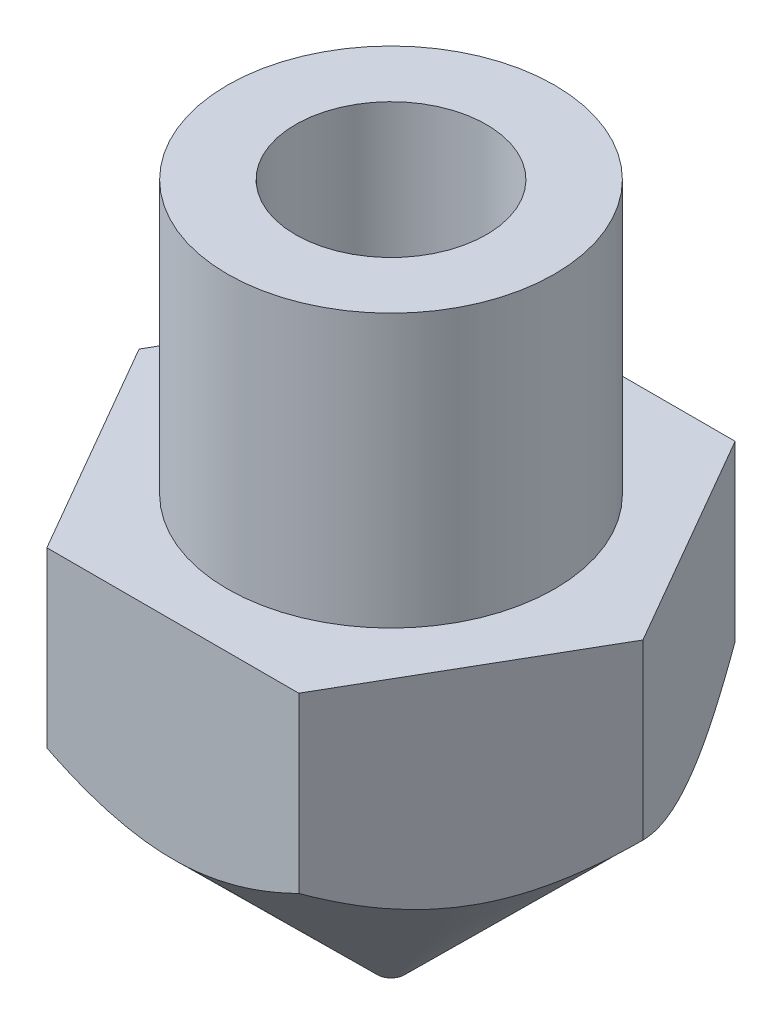
ISO-10303-21;
HEADER;
FILE_DESCRIPTION(('STEP AP214'),'2;1');
FILE_NAME('part.step','',(''),(''),'','','');
FILE_SCHEMA(('AUTOMOTIVE_DESIGN { 1 0 10303 214 1 1 1 1 }'));
ENDSEC;
DATA;
#1=APPLICATION_CONTEXT('core data for automotive mechanical design processes');
#2=APPLICATION_PROTOCOL_DEFINITION('international standard','automotive_design',2000,#1);
#3=PRODUCT_CONTEXT('',#1,'mechanical');
#4=PRODUCT('Part','Part','',(#3));
#5=PRODUCT_RELATED_PRODUCT_CATEGORY('part','',(#4));
#6=PRODUCT_DEFINITION_FORMATION('','',#4);
#7=PRODUCT_DEFINITION_CONTEXT('part definition',#1,'design');
#8=PRODUCT_DEFINITION('design','',#6,#7);
#9=PRODUCT_DEFINITION_SHAPE('','',#8);
#10=(LENGTH_UNIT() NAMED_UNIT(*) SI_UNIT(.MILLI.,.METRE.));
#11=(NAMED_UNIT(*) PLANE_ANGLE_UNIT() SI_UNIT($,.RADIAN.));
#12=(NAMED_UNIT(*) SI_UNIT($,.STERADIAN.) SOLID_ANGLE_UNIT());
#13=UNCERTAINTY_MEASURE_WITH_UNIT(LENGTH_MEASURE(1.E-05),#10,'distance_accuracy_value','');
#14=(GEOMETRIC_REPRESENTATION_CONTEXT(3) GLOBAL_UNCERTAINTY_ASSIGNED_CONTEXT((#13)) GLOBAL_UNIT_ASSIGNED_CONTEXT((#10,
#11,#12)) REPRESENTATION_CONTEXT('',''));
#15=CARTESIAN_POINT('',(0.,0.,0.));
#16=DIRECTION('',(0.,0.,1.));
#17=DIRECTION('',(1.,0.,0.));
#18=AXIS2_PLACEMENT_3D('',#15,#16,#17);
#19=CARTESIAN_POINT('',(0.,7.5,0.));
#20=DIRECTION('',(0.,1.,0.));
#21=DIRECTION('',(0.,0.,1.));
#22=AXIS2_PLACEMENT_3D('',#19,#20,#21);
#23=PLANE('',#22);
#24=DIRECTION('',(1.,0.,0.));
#25=VECTOR('',#24,1.);
#26=CARTESIAN_POINT('',(-2.3094010767585,7.5,4.));
#27=LINE('',#26,#25);
#28=CARTESIAN_POINT('',(-2.3094010767585,7.5,4.));
#29=VERTEX_POINT('',#28);
#30=CARTESIAN_POINT('',(2.3094010767585,7.5,4.));
#31=VERTEX_POINT('',#30);
#32=EDGE_CURVE('E145',#29,#31,#27,.T.);
#33=ORIENTED_EDGE('',*,*,#32,.T.);
#34=DIRECTION('',(0.5,0.,-0.866025403784439));
#35=VECTOR('',#34,1.);
#36=CARTESIAN_POINT('',(2.3094010767585,7.5,4.));
#37=LINE('',#36,#35);
#38=CARTESIAN_POINT('',(4.61880215351701,7.5,0.));
#39=VERTEX_POINT('',#38);
#40=EDGE_CURVE('E95',#31,#39,#37,.T.);
#41=ORIENTED_EDGE('',*,*,#40,.T.);
#42=DIRECTION('',(-0.5,0.,-0.866025403784438));
#43=VECTOR('',#42,1.);
#44=CARTESIAN_POINT('',(4.61880215351701,7.5,0.));
#45=LINE('',#44,#43);
#46=CARTESIAN_POINT('',(2.3094010767585,7.5,-4.));
#47=VERTEX_POINT('',#46);
#48=EDGE_CURVE('E153',#39,#47,#45,.T.);
#49=ORIENTED_EDGE('',*,*,#48,.T.);
#50=DIRECTION('',(-1.,0.,0.));
#51=VECTOR('',#50,1.);
#52=CARTESIAN_POINT('',(2.3094010767585,7.5,-4.));
#53=LINE('',#52,#51);
#54=CARTESIAN_POINT('',(-2.3094010767585,7.5,-4.));
#55=VERTEX_POINT('',#54);
#56=EDGE_CURVE('E155',#47,#55,#53,.T.);
#57=ORIENTED_EDGE('',*,*,#56,.T.);
#58=DIRECTION('',(-0.5,0.,0.866025403784439));
#59=VECTOR('',#58,1.);
#60=CARTESIAN_POINT('',(-2.3094010767585,7.5,-4.));
#61=LINE('',#60,#59);
#62=CARTESIAN_POINT('',(-4.61880215351701,7.5,0.));
#63=VERTEX_POINT('',#62);
#64=EDGE_CURVE('E157',#55,#63,#61,.T.);
#65=ORIENTED_EDGE('',*,*,#64,.T.);
#66=DIRECTION('',(0.5,0.,0.866025403784439));
#67=VECTOR('',#66,1.);
#68=CARTESIAN_POINT('',(-4.61880215351701,7.5,0.));
#69=LINE('',#68,#67);
#70=EDGE_CURVE('E57',#63,#29,#69,.T.);
#71=ORIENTED_EDGE('',*,*,#70,.T.);
#72=EDGE_LOOP('',(#33,#41,#49,#57,#65,#71));
#73=FACE_BOUND('',#72,.T.);
#74=CARTESIAN_POINT('',(0.,7.5,0.));
#75=DIRECTION('',(0.,1.,0.));
#76=DIRECTION('',(0.,0.,1.));
#77=AXIS2_PLACEMENT_3D('',#74,#75,#76);
#78=CIRCLE('',#77,3.);
#79=CARTESIAN_POINT('',(0.,7.5,3.));
#80=VERTEX_POINT('',#79);
#81=EDGE_CURVE('E185',#80,#80,#78,.T.);
#82=ORIENTED_EDGE('',*,*,#81,.F.);
#83=EDGE_LOOP('',(#82));
#84=FACE_BOUND('',#83,.T.);
#85=ADVANCED_FACE('F34',(#73,#84),#23,.T.);
#86=CARTESIAN_POINT('',(0.,4.5,0.));
#87=DIRECTION('',(0.,1.,0.));
#88=DIRECTION('',(0.,0.,1.));
#89=AXIS2_PLACEMENT_3D('',#86,#87,#88);
#90=CONICAL_SURFACE('',#89,4.8,0.790922969063121);
#91=CARTESIAN_POINT('',(0.,0.,0.));
#92=DIRECTION('',(0.,-1.,0.));
#93=DIRECTION('',(0.,0.,-1.));
#94=AXIS2_PLACEMENT_3D('',#91,#92,#93);
#95=CIRCLE('',#94,0.25);
#96=CARTESIAN_POINT('',(0.,0.,-0.25));
#97=VERTEX_POINT('',#96);
#98=EDGE_CURVE('E42',#97,#97,#95,.T.);
#99=ORIENTED_EDGE('',*,*,#98,.F.);
#100=EDGE_LOOP('',(#99));
#101=FACE_BOUND('',#100,.T.);
#102=CARTESIAN_POINT('',(-4.61891762357085,4.32090754407778,-0.000199999999998878));
#103=CARTESIAN_POINT('',(-4.57882495548949,4.28125961564317,0.0692425381279071));
#104=CARTESIAN_POINT('',(-4.53842796110676,4.24284516066987,0.139212184871867));
#105=CARTESIAN_POINT('',(-4.4569628253499,4.16885983041855,0.280313939048247));
#106=CARTESIAN_POINT('',(-4.41589432989499,4.13329051770299,0.351446659766554));
#107=CARTESIAN_POINT('',(-4.29121033757663,4.03111562789061,0.567405669352489));
#108=CARTESIAN_POINT('',(-4.20654503780905,3.96947665873758,0.714050270187991));
#109=CARTESIAN_POINT('',(-4.03589702788696,3.86422368139055,1.00962129358357));
#110=CARTESIAN_POINT('',(-3.94995729149691,3.82033617404732,1.1584732834002));
#111=CARTESIAN_POINT('',(-3.77623311133247,3.75315653543825,1.45937238994826));
#112=CARTESIAN_POINT('',(-3.68845382855752,3.7298130815824,1.61141056756643));
#113=CARTESIAN_POINT('',(-3.53675604717737,3.70940505433758,1.87415883231233));
#114=CARTESIAN_POINT('',(-3.47301486726647,3.70682488068493,1.98456179445239));
#115=CARTESIAN_POINT('',(-3.34566913691557,3.71372264549082,2.20513106954712));
#116=CARTESIAN_POINT('',(-3.28206464483688,3.72320498548024,2.31529728141703));
#117=CARTESIAN_POINT('',(-3.15549048959605,3.75367773030943,2.53453014921925));
#118=CARTESIAN_POINT('',(-3.09252161957529,3.77468104696966,2.6435954313904));
#119=CARTESIAN_POINT('',(-2.96768892179338,3.82704161264196,2.85981200639457));
#120=CARTESIAN_POINT('',(-2.905825003388,3.85839800819329,2.96696345622798));
#121=CARTESIAN_POINT('',(-2.79838956072751,3.92127040601549,3.1530471014496));
#122=CARTESIAN_POINT('',(-2.75253243548431,3.95087328101029,3.23247397225988));
#123=CARTESIAN_POINT('',(-2.66160326124224,4.01454526107256,3.38996792193743));
#124=CARTESIAN_POINT('',(-2.61653119364528,4.04861426017364,3.46803503301754));
#125=CARTESIAN_POINT('',(-2.52732037219057,4.12050605923579,3.62255270836204));
#126=CARTESIAN_POINT('',(-2.48317903489612,4.15831613605795,3.69900774727008));
#127=CARTESIAN_POINT('',(-2.3956675049615,4.23725128508008,3.85058216336492));
#128=CARTESIAN_POINT('',(-2.35229695170507,4.2783747544414,3.92570216515743));
#129=CARTESIAN_POINT('',(-2.30928560670467,4.32090754407778,4.0002));
#130=B_SPLINE_CURVE_WITH_KNOTS('',3,(#102,#103,#104,#105,#106,#107,#108,#109,#110,#111,#112,
#113,#114,#115,#116,#117,#118,#119,#120,#121,#122,#123,#124,#125,#126,#127,#128,#129),
.UNSPECIFIED.,.F.,.F.,(4,2,2,2,2,2,2,2,2,2,2,2,2,4),(0.,0.268335404709064,0.536817182543903,
1.07665606883723,1.60782795457851,2.13766908351982,2.51964973618756,2.90176981103991,
3.28431901412438,3.66683668946327,3.9558384161142,4.24483328694775,4.53287704734197,
4.82078229494866),.UNSPECIFIED.);
#131=CARTESIAN_POINT('',(-4.61880215351701,4.3207933386432,0.));
#132=VERTEX_POINT('',#131);
#133=CARTESIAN_POINT('',(-2.3094010767585,4.3207933386432,4.));
#134=VERTEX_POINT('',#133);
#135=EDGE_CURVE('E139',#132,#134,#130,.T.);
#136=ORIENTED_EDGE('',*,*,#135,.F.);
#137=CARTESIAN_POINT('',(-2.30928560670467,4.32090754407778,-4.0002));
#138=CARTESIAN_POINT('',(-2.34937827478602,4.28125961564317,-3.9307574618721));
#139=CARTESIAN_POINT('',(-2.38977526916875,4.24284516066987,-3.86078781512814));
#140=CARTESIAN_POINT('',(-2.47124040492561,4.16885983041855,-3.71968606095176));
#141=CARTESIAN_POINT('',(-2.51230890038052,4.13329051770299,-3.64855334023345));
#142=CARTESIAN_POINT('',(-2.63699289269888,4.03111562789061,-3.43259433064751));
#143=CARTESIAN_POINT('',(-2.72165819246647,3.96947665873758,-3.28594972981201));
#144=CARTESIAN_POINT('',(-2.89230620238856,3.86422368139055,-2.99037870641643));
#145=CARTESIAN_POINT('',(-2.9782459387786,3.82033617404732,-2.8415267165998));
#146=CARTESIAN_POINT('',(-3.15197011894304,3.75315653543825,-2.54062761005174));
#147=CARTESIAN_POINT('',(-3.23974940171799,3.7298130815824,-2.38858943243357));
#148=CARTESIAN_POINT('',(-3.39144718309814,3.70940505433758,-2.12584116768767));
#149=CARTESIAN_POINT('',(-3.45518836300904,3.70682488068493,-2.01543820554761));
#150=CARTESIAN_POINT('',(-3.58253409335994,3.71372264549082,-1.79486893045288));
#151=CARTESIAN_POINT('',(-3.64613858543864,3.72320498548024,-1.68470271858297));
#152=CARTESIAN_POINT('',(-3.77271274067946,3.75367773030943,-1.46546985078075));
#153=CARTESIAN_POINT('',(-3.83568161070022,3.77468104696966,-1.3564045686096));
#154=CARTESIAN_POINT('',(-3.96051430848213,3.82704161264196,-1.14018799360543));
#155=CARTESIAN_POINT('',(-4.02237822688751,3.85839800819329,-1.03303654377202));
#156=CARTESIAN_POINT('',(-4.129813669548,3.92127040601549,-0.846952898550396));
#157=CARTESIAN_POINT('',(-4.17567079479121,3.95087328101029,-0.767526027740119));
#158=CARTESIAN_POINT('',(-4.26659996903328,4.01454526107256,-0.610032078062571));
#159=CARTESIAN_POINT('',(-4.31167203663024,4.04861426017364,-0.531964966982455));
#160=CARTESIAN_POINT('',(-4.40088285808494,4.12050605923579,-0.377447291637957));
#161=CARTESIAN_POINT('',(-4.44502419537939,4.15831613605795,-0.300992252729924));
#162=CARTESIAN_POINT('',(-4.53253572531402,4.23725128508008,-0.149417836635076));
#163=CARTESIAN_POINT('',(-4.57590627857044,4.2783747544414,-0.0742978348425742));
#164=CARTESIAN_POINT('',(-4.61891762357085,4.32090754407778,0.000200000000001305));
#165=B_SPLINE_CURVE_WITH_KNOTS('',3,(#137,#138,#139,#140,#141,#142,#143,#144,#145,#146,#147,
#148,#149,#150,#151,#152,#153,#154,#155,#156,#157,#158,#159,#160,#161,#162,#163,#164),
.UNSPECIFIED.,.F.,.F.,(4,2,2,2,2,2,2,2,2,2,2,2,2,4),(0.,0.268335404709064,0.536817182543904,
1.07665606883723,1.60782795457851,2.13766908351982,2.51964973618756,2.90176981103992,
3.28431901412438,3.66683668946327,3.9558384161142,4.24483328694776,4.53287704734197,
4.82078229494866),.UNSPECIFIED.);
#166=CARTESIAN_POINT('',(-2.3094010767585,4.3207933386432,-4.));
#167=VERTEX_POINT('',#166);
#168=EDGE_CURVE('E146',#167,#132,#165,.T.);
#169=ORIENTED_EDGE('',*,*,#168,.F.);
#170=CARTESIAN_POINT('',(-4.77731163857638,5.91506405424429,-4.));
#171=CARTESIAN_POINT('',(-4.66126077615507,5.82708243242729,-4.));
#172=CARTESIAN_POINT('',(-4.54458595953393,5.73991073738884,-4.));
#173=CARTESIAN_POINT('',(-4.30973514801779,5.56755604823035,-4.));
#174=CARTESIAN_POINT('',(-4.19155880023948,5.48237353546564,-4.));
#175=CARTESIAN_POINT('',(-3.95259320215688,5.31376379565094,-4.));
#176=CARTESIAN_POINT('',(-3.83179085699568,5.23035506613229,-4.));
#177=CARTESIAN_POINT('',(-3.58818823690221,5.066517915432,-4.));
#178=CARTESIAN_POINT('',(-3.46538810041314,4.98608928899012,-4.));
#179=CARTESIAN_POINT('',(-3.20990578421158,4.82409833288653,-4.));
#180=CARTESIAN_POINT('',(-3.0770773635718,4.74276548234395,-4.));
#181=CARTESIAN_POINT('',(-2.80834425852088,4.5852657014932,-4.));
#182=CARTESIAN_POINT('',(-2.67243907554901,4.50909961651893,-4.));
#183=CARTESIAN_POINT('',(-2.3975330469381,4.36356734094716,-4.));
#184=CARTESIAN_POINT('',(-2.25854277846152,4.29418132754458,-4.));
#185=CARTESIAN_POINT('',(-1.9767234113964,4.16377376687841,-4.));
#186=CARTESIAN_POINT('',(-1.83389612106276,4.10274835947904,-4.));
#187=CARTESIAN_POINT('',(-1.55689665945426,3.99618374238921,-4.));
#188=CARTESIAN_POINT('',(-1.4230707936948,3.94975378193443,-4.));
#189=CARTESIAN_POINT('',(-1.15209990028743,3.86764138985129,-4.));
#190=CARTESIAN_POINT('',(-1.01495467741829,3.83195959202167,-4.));
#191=CARTESIAN_POINT('',(-0.740528034138379,3.77387377310477,-4.));
#192=CARTESIAN_POINT('',(-0.603297635734252,3.75123276625611,-4.));
#193=CARTESIAN_POINT('',(-0.327257805551723,3.719695915279,-4.));
#194=CARTESIAN_POINT('',(-0.18844868571891,3.71079740166846,-4.));
#195=CARTESIAN_POINT('',(0.0833156577788038,3.70746600345174,-4.));
#196=CARTESIAN_POINT('',(0.216263603134462,3.71242233216546,-4.));
#197=CARTESIAN_POINT('',(0.481050632819944,3.73515969728192,-4.));
#198=CARTESIAN_POINT('',(0.61288961086402,3.75294194909353,-4.));
#199=CARTESIAN_POINT('',(0.876775078791357,3.80064094216838,-4.));
#200=CARTESIAN_POINT('',(1.00878239537222,3.83077083014268,-4.));
#201=CARTESIAN_POINT('',(1.26990142237993,3.90151183394888,-4.));
#202=CARTESIAN_POINT('',(1.39901334083412,3.94212219414503,-4.));
#203=CARTESIAN_POINT('',(1.66582577894707,4.0362079876809,-4.));
#204=CARTESIAN_POINT('',(1.80322749879138,4.090521906478,-4.));
#205=CARTESIAN_POINT('',(2.07445199406885,4.20751937722464,-4.));
#206=CARTESIAN_POINT('',(2.2082730347371,4.2702069009376,-4.));
#207=CARTESIAN_POINT('',(2.4730058716959,4.40243105185092,-4.));
#208=CARTESIAN_POINT('',(2.60390674536753,4.47198936864017,-4.));
#209=CARTESIAN_POINT('',(2.86270843295825,4.61639805908972,-4.));
#210=CARTESIAN_POINT('',(2.99060973059525,4.69124757155634,-4.));
#211=CARTESIAN_POINT('',(3.23735926977747,4.84125627690671,-4.));
#212=CARTESIAN_POINT('',(3.35633636859995,4.9162046400833,-4.));
#213=CARTESIAN_POINT('',(3.59227321634881,5.06922174513348,-4.));
#214=CARTESIAN_POINT('',(3.70923281229704,5.14729072215322,-4.));
#215=CARTESIAN_POINT('',(3.94044605067062,5.30533524637891,-4.));
#216=CARTESIAN_POINT('',(4.05471401674976,5.38528991359446,-4.));
#217=CARTESIAN_POINT('',(4.28171556850662,5.54728644366551,-4.));
#218=CARTESIAN_POINT('',(4.39444956330772,5.62932773256148,-4.));
#219=CARTESIAN_POINT('',(4.50654316396615,5.71222016617809,-4.));
#220=B_SPLINE_CURVE_WITH_KNOTS('',3,(#170,#171,#172,#173,#174,#175,#176,#177,#178,#179,#180,
#181,#182,#183,#184,#185,#186,#187,#188,#189,#190,#191,#192,#193,#194,#195,#196,#197,#198,#199,
#200,#201,#202,#203,#204,#205,#206,#207,#208,#209,#210,#211,#212,#213,#214,#215,#216,#217,#218,
#219),.UNSPECIFIED.,.F.,.F.,(4,2,2,2,2,2,2,2,2,2,2,2,2,2,2,2,2,2,2,2,2,2,2,2,4),(0.,
0.436903027960649,0.873910707379933,1.31427355986555,1.75460602493115,2.22176628086166,
2.68900278539696,3.15482957774581,3.62044056533128,4.04502412567262,4.46963271800162,
4.88625956049741,5.30280546296068,5.70128120465317,6.09979471162629,6.50549835949394,
6.91117276454016,7.35406596369784,7.7971699866349,8.24172043657765,8.68619869745564,
9.10798885745471,9.52981086054628,9.9481743524885,10.3664239853633),.UNSPECIFIED.);
#221=CARTESIAN_POINT('',(2.3094010767585,4.3207933386432,-4.));
#222=VERTEX_POINT('',#221);
#223=EDGE_CURVE('E111',#222,#167,#220,.F.);
#224=ORIENTED_EDGE('',*,*,#223,.F.);
#225=CARTESIAN_POINT('',(4.61891762357084,4.32090754407778,0.000199999999999095));
#226=CARTESIAN_POINT('',(4.57882495548949,4.28125961564317,-0.0692425381279069));
#227=CARTESIAN_POINT('',(4.53842796110676,4.24284516066986,-0.139212184871867));
#228=CARTESIAN_POINT('',(4.4569628253499,4.16885983041854,-0.280313939048247));
#229=CARTESIAN_POINT('',(4.41589432989499,4.13329051770299,-0.351446659766554));
#230=CARTESIAN_POINT('',(4.29121033757663,4.03111562789061,-0.567405669352489));
#231=CARTESIAN_POINT('',(4.20654503780904,3.96947665873758,-0.714050270187991));
#232=CARTESIAN_POINT('',(4.03589702788696,3.86422368139055,-1.00962129358357));
#233=CARTESIAN_POINT('',(3.94995729149691,3.82033617404732,-1.1584732834002));
#234=CARTESIAN_POINT('',(3.77623311133247,3.75315653543825,-1.45937238994827));
#235=CARTESIAN_POINT('',(3.68845382855752,3.7298130815824,-1.61141056756643));
#236=CARTESIAN_POINT('',(3.53675604717737,3.70940505433758,-1.87415883231233));
#237=CARTESIAN_POINT('',(3.47301486726647,3.70682488068492,-1.98456179445239));
#238=CARTESIAN_POINT('',(3.34566913691557,3.71372264549082,-2.20513106954712));
#239=CARTESIAN_POINT('',(3.28206464483687,3.72320498548024,-2.31529728141703));
#240=CARTESIAN_POINT('',(3.15549048959605,3.75367773030943,-2.53453014921925));
#241=CARTESIAN_POINT('',(3.09252161957529,3.77468104696966,-2.6435954313904));
#242=CARTESIAN_POINT('',(2.96768892179338,3.82704161264196,-2.85981200639457));
#243=CARTESIAN_POINT('',(2.905825003388,3.85839800819329,-2.96696345622798));
#244=CARTESIAN_POINT('',(2.79838956072751,3.92127040601549,-3.1530471014496));
#245=CARTESIAN_POINT('',(2.7525324354843,3.95087328101029,-3.23247397225988));
#246=CARTESIAN_POINT('',(2.66160326124223,4.01454526107256,-3.38996792193743));
#247=CARTESIAN_POINT('',(2.61653119364527,4.04861426017364,-3.46803503301755));
#248=CARTESIAN_POINT('',(2.52732037219057,4.12050605923579,-3.62255270836204));
#249=CARTESIAN_POINT('',(2.48317903489611,4.15831613605795,-3.69900774727008));
#250=CARTESIAN_POINT('',(2.39566750496149,4.23725128508008,-3.85058216336493));
#251=CARTESIAN_POINT('',(2.35229695170507,4.2783747544414,-3.92570216515743));
#252=CARTESIAN_POINT('',(2.30928560670466,4.32090754407778,-4.0002));
#253=B_SPLINE_CURVE_WITH_KNOTS('',3,(#225,#226,#227,#228,#229,#230,#231,#232,#233,#234,#235,
#236,#237,#238,#239,#240,#241,#242,#243,#244,#245,#246,#247,#248,#249,#250,#251,#252),
.UNSPECIFIED.,.F.,.F.,(4,2,2,2,2,2,2,2,2,2,2,2,2,4),(0.,0.268335404709065,0.536817182543903,
1.07665606883723,1.60782795457851,2.13766908351982,2.51964973618756,2.90176981103992,
3.28431901412438,3.66683668946327,3.9558384161142,4.24483328694775,4.53287704734197,
4.82078229494866),.UNSPECIFIED.);
#254=CARTESIAN_POINT('',(4.61880215351701,4.32079333864319,0.));
#255=VERTEX_POINT('',#254);
#256=EDGE_CURVE('E109',#255,#222,#253,.T.);
#257=ORIENTED_EDGE('',*,*,#256,.F.);
#258=CARTESIAN_POINT('',(2.30928560670467,4.32090754407778,4.0002));
#259=CARTESIAN_POINT('',(2.34937827478602,4.28125961564317,3.9307574618721));
#260=CARTESIAN_POINT('',(2.38977526916875,4.24284516066986,3.86078781512813));
#261=CARTESIAN_POINT('',(2.47124040492561,4.16885983041855,3.71968606095175));
#262=CARTESIAN_POINT('',(2.51230890038052,4.13329051770299,3.64855334023345));
#263=CARTESIAN_POINT('',(2.63699289269888,4.03111562789061,3.43259433064751));
#264=CARTESIAN_POINT('',(2.72165819246647,3.96947665873758,3.28594972981201));
#265=CARTESIAN_POINT('',(2.89230620238855,3.86422368139055,2.99037870641643));
#266=CARTESIAN_POINT('',(2.9782459387786,3.82033617404732,2.8415267165998));
#267=CARTESIAN_POINT('',(3.15197011894304,3.75315653543825,2.54062761005174));
#268=CARTESIAN_POINT('',(3.23974940171799,3.7298130815824,2.38858943243357));
#269=CARTESIAN_POINT('',(3.39144718309814,3.70940505433758,2.12584116768768));
#270=CARTESIAN_POINT('',(3.45518836300904,3.70682488068493,2.01543820554761));
#271=CARTESIAN_POINT('',(3.58253409335994,3.71372264549082,1.79486893045288));
#272=CARTESIAN_POINT('',(3.64613858543863,3.72320498548024,1.68470271858297));
#273=CARTESIAN_POINT('',(3.77271274067946,3.75367773030943,1.46546985078075));
#274=CARTESIAN_POINT('',(3.83568161070022,3.77468104696966,1.3564045686096));
#275=CARTESIAN_POINT('',(3.96051430848213,3.82704161264196,1.14018799360543));
#276=CARTESIAN_POINT('',(4.02237822688751,3.85839800819329,1.03303654377202));
#277=CARTESIAN_POINT('',(4.129813669548,3.92127040601549,0.846952898550396));
#278=CARTESIAN_POINT('',(4.1756707947912,3.95087328101029,0.767526027740119));
#279=CARTESIAN_POINT('',(4.26659996903327,4.01454526107257,0.61003207806257));
#280=CARTESIAN_POINT('',(4.31167203663024,4.04861426017364,0.531964966982455));
#281=CARTESIAN_POINT('',(4.40088285808494,4.12050605923579,0.377447291637957));
#282=CARTESIAN_POINT('',(4.44502419537939,4.15831613605795,0.300992252729923));
#283=CARTESIAN_POINT('',(4.53253572531401,4.23725128508008,0.149417836635076));
#284=CARTESIAN_POINT('',(4.57590627857044,4.2783747544414,0.074297834842574));
#285=CARTESIAN_POINT('',(4.61891762357084,4.32090754407778,-0.000200000000001339));
#286=B_SPLINE_CURVE_WITH_KNOTS('',3,(#258,#259,#260,#261,#262,#263,#264,#265,#266,#267,#268,
#269,#270,#271,#272,#273,#274,#275,#276,#277,#278,#279,#280,#281,#282,#283,#284,#285),
.UNSPECIFIED.,.F.,.F.,(4,2,2,2,2,2,2,2,2,2,2,2,2,4),(0.,0.268335404709065,0.536817182543904,
1.07665606883723,1.60782795457851,2.13766908351982,2.51964973618756,2.90176981103992,
3.28431901412438,3.66683668946327,3.9558384161142,4.24483328694776,4.53287704734197,
4.82078229494866),.UNSPECIFIED.);
#287=CARTESIAN_POINT('',(2.3094010767585,4.3207933386432,4.));
#288=VERTEX_POINT('',#287);
#289=EDGE_CURVE('E93',#288,#255,#286,.T.);
#290=ORIENTED_EDGE('',*,*,#289,.F.);
#291=CARTESIAN_POINT('',(-4.77731163857638,5.91506405424429,4.));
#292=CARTESIAN_POINT('',(-4.66126077615507,5.82708243242729,4.));
#293=CARTESIAN_POINT('',(-4.54458595953393,5.73991073738884,4.));
#294=CARTESIAN_POINT('',(-4.30973514801779,5.56755604823035,4.));
#295=CARTESIAN_POINT('',(-4.19155880023948,5.48237353546564,4.));
#296=CARTESIAN_POINT('',(-3.95259320215687,5.31376379565093,4.));
#297=CARTESIAN_POINT('',(-3.83179085699568,5.23035506613229,4.));
#298=CARTESIAN_POINT('',(-3.58818823690221,5.066517915432,4.));
#299=CARTESIAN_POINT('',(-3.46538810041313,4.98608928899012,4.));
#300=CARTESIAN_POINT('',(-3.20990578421158,4.82409833288653,4.));
#301=CARTESIAN_POINT('',(-3.0770773635718,4.74276548234395,4.));
#302=CARTESIAN_POINT('',(-2.80834425852088,4.5852657014932,4.));
#303=CARTESIAN_POINT('',(-2.672439075549,4.50909961651893,4.));
#304=CARTESIAN_POINT('',(-2.3975330469381,4.36356734094716,4.));
#305=CARTESIAN_POINT('',(-2.25854277846152,4.29418132754458,4.));
#306=CARTESIAN_POINT('',(-1.9767234113964,4.16377376687841,4.));
#307=CARTESIAN_POINT('',(-1.83389612106276,4.10274835947904,4.));
#308=CARTESIAN_POINT('',(-1.55689665945426,3.99618374238921,4.));
#309=CARTESIAN_POINT('',(-1.4230707936948,3.94975378193443,4.));
#310=CARTESIAN_POINT('',(-1.15209990028743,3.86764138985129,4.));
#311=CARTESIAN_POINT('',(-1.01495467741829,3.83195959202167,4.));
#312=CARTESIAN_POINT('',(-0.740528034138379,3.77387377310477,4.));
#313=CARTESIAN_POINT('',(-0.60329763573425,3.75123276625611,4.));
#314=CARTESIAN_POINT('',(-0.327257805551722,3.719695915279,4.));
#315=CARTESIAN_POINT('',(-0.188448685718909,3.71079740166846,4.));
#316=CARTESIAN_POINT('',(0.0833156577788047,3.70746600345174,4.));
#317=CARTESIAN_POINT('',(0.216263603134463,3.71242233216546,4.));
#318=CARTESIAN_POINT('',(0.481050632819945,3.73515969728192,4.));
#319=CARTESIAN_POINT('',(0.612889610864021,3.75294194909353,4.));
#320=CARTESIAN_POINT('',(0.876775078791358,3.80064094216838,4.));
#321=CARTESIAN_POINT('',(1.00878239537222,3.83077083014268,4.));
#322=CARTESIAN_POINT('',(1.26990142237993,3.90151183394888,4.));
#323=CARTESIAN_POINT('',(1.39901334083412,3.94212219414502,4.));
#324=CARTESIAN_POINT('',(1.66582577894707,4.0362079876809,4.));
#325=CARTESIAN_POINT('',(1.80322749879138,4.090521906478,4.));
#326=CARTESIAN_POINT('',(2.07445199406885,4.20751937722464,4.));
#327=CARTESIAN_POINT('',(2.2082730347371,4.2702069009376,4.));
#328=CARTESIAN_POINT('',(2.4730058716959,4.40243105185092,4.));
#329=CARTESIAN_POINT('',(2.60390674536753,4.47198936864017,4.));
#330=CARTESIAN_POINT('',(2.86270843295825,4.61639805908972,4.));
#331=CARTESIAN_POINT('',(2.99060973059525,4.69124757155633,4.));
#332=CARTESIAN_POINT('',(3.23735926977747,4.84125627690671,4.));
#333=CARTESIAN_POINT('',(3.35633636859995,4.9162046400833,4.));
#334=CARTESIAN_POINT('',(3.59227321634881,5.06922174513348,4.));
#335=CARTESIAN_POINT('',(3.70923281229704,5.14729072215322,4.));
#336=CARTESIAN_POINT('',(3.94044605067062,5.30533524637891,4.));
#337=CARTESIAN_POINT('',(4.05471401674976,5.38528991359445,4.));
#338=CARTESIAN_POINT('',(4.28171556850662,5.54728644366551,4.));
#339=CARTESIAN_POINT('',(4.39444956330771,5.62932773256148,4.));
#340=CARTESIAN_POINT('',(4.50654316396614,5.71222016617809,4.));
#341=B_SPLINE_CURVE_WITH_KNOTS('',3,(#291,#292,#293,#294,#295,#296,#297,#298,#299,#300,#301,
#302,#303,#304,#305,#306,#307,#308,#309,#310,#311,#312,#313,#314,#315,#316,#317,#318,#319,#320,
#321,#322,#323,#324,#325,#326,#327,#328,#329,#330,#331,#332,#333,#334,#335,#336,#337,#338,#339,
#340),.UNSPECIFIED.,.F.,.F.,(4,2,2,2,2,2,2,2,2,2,2,2,2,2,2,2,2,2,2,2,2,2,2,2,4),(0.,
0.436903027960647,0.873910707379933,1.31427355986555,1.75460602493115,2.22176628086166,
2.68900278539696,3.15482957774581,3.62044056533128,4.04502412567262,4.46963271800162,
4.88625956049741,5.30280546296068,5.70128120465317,6.09979471162629,6.50549835949394,
6.91117276454016,7.35406596369784,7.7971699866349,8.24172043657765,8.68619869745563,
9.1079888574547,9.52981086054628,9.9481743524885,10.3664239853633),.UNSPECIFIED.);
#342=EDGE_CURVE('E100',#134,#288,#341,.T.);
#343=ORIENTED_EDGE('',*,*,#342,.F.);
#344=EDGE_LOOP('',(#136,#169,#224,#257,#290,#343));
#345=FACE_BOUND('',#344,.T.);
#346=ADVANCED_FACE('F106',(#101,#345),#90,.T.);
#347=CARTESIAN_POINT('',(0.,0.,0.));
#348=DIRECTION('',(0.,1.,0.));
#349=DIRECTION('',(0.,0.,1.));
#350=AXIS2_PLACEMENT_3D('',#347,#348,#349);
#351=CONICAL_SURFACE('',#350,0.2,0.523598775598293);
#352=CARTESIAN_POINT('',(0.,2.6846787517318,0.));
#353=DIRECTION('',(0.,-1.,0.));
#354=DIRECTION('',(0.,0.,-1.));
#355=AXIS2_PLACEMENT_3D('',#352,#353,#354);
#356=CIRCLE('',#355,1.75);
#357=CARTESIAN_POINT('',(0.,2.6846787517318,1.75));
#358=VERTEX_POINT('',#357);
#359=EDGE_CURVE('E96',#358,#358,#356,.T.);
#360=CARTESIAN_POINT('',(0.,0.,0.));
#361=DIRECTION('',(0.,-1.,0.));
#362=DIRECTION('',(0.,0.,-1.));
#363=AXIS2_PLACEMENT_3D('',#360,#361,#362);
#364=CIRCLE('',#363,0.2);
#365=CARTESIAN_POINT('',(0.,0.,0.2));
#366=VERTEX_POINT('',#365);
#367=EDGE_CURVE('E11',#366,#366,#364,.T.);
#368=CARTESIAN_POINT('',(0.,2.6846787517318,1.75));
#369=CARTESIAN_POINT('',(0.,2.65671334806792,1.73385416666667));
#370=CARTESIAN_POINT('',(0.,2.62874794440405,1.71770833333333));
#371=CARTESIAN_POINT('',(0.,2.57281713707631,1.68541666666667));
#372=CARTESIAN_POINT('',(0.,2.54485173341243,1.66927083333333));
#373=CARTESIAN_POINT('',(0.,2.48892092608469,1.63697916666667));
#374=CARTESIAN_POINT('',(0.,2.46095552242081,1.62083333333333));
#375=CARTESIAN_POINT('',(0.,2.40502471509307,1.58854166666667));
#376=CARTESIAN_POINT('',(0.,2.37705931142919,1.57239583333333));
#377=CARTESIAN_POINT('',(0.,2.32112850410145,1.54010416666667));
#378=CARTESIAN_POINT('',(0.,2.29316310043758,1.52395833333333));
#379=CARTESIAN_POINT('',(0.,2.23723229310983,1.49166666666667));
#380=CARTESIAN_POINT('',(0.,2.20926688944596,1.47552083333333));
#381=CARTESIAN_POINT('',(0.,2.15333608211821,1.44322916666667));
#382=CARTESIAN_POINT('',(0.,2.12537067845434,1.42708333333333));
#383=CARTESIAN_POINT('',(0.,2.06943987112659,1.39479166666667));
#384=CARTESIAN_POINT('',(0.,2.04147446746272,1.37864583333333));
#385=CARTESIAN_POINT('',(0.,1.98554366013497,1.34635416666667));
#386=CARTESIAN_POINT('',(0.,1.9575782564711,1.33020833333333));
#387=CARTESIAN_POINT('',(0.,1.90164744914336,1.29791666666667));
#388=CARTESIAN_POINT('',(0.,1.87368204547948,1.28177083333333));
#389=CARTESIAN_POINT('',(0.,1.81775123815174,1.24947916666667));
#390=CARTESIAN_POINT('',(0.,1.78978583448786,1.23333333333333));
#391=CARTESIAN_POINT('',(0.,1.73385502716012,1.20104166666667));
#392=CARTESIAN_POINT('',(0.,1.70588962349625,1.18489583333333));
#393=CARTESIAN_POINT('',(0.,1.6499588161685,1.15260416666667));
#394=CARTESIAN_POINT('',(0.,1.62199341250463,1.13645833333333));
#395=CARTESIAN_POINT('',(0.,1.56606260517688,1.10416666666667));
#396=CARTESIAN_POINT('',(0.,1.53809720151301,1.08802083333333));
#397=CARTESIAN_POINT('',(0.,1.48216639418526,1.05572916666667));
#398=CARTESIAN_POINT('',(0.,1.45420099052139,1.03958333333333));
#399=CARTESIAN_POINT('',(0.,1.39827018319364,1.00729166666667));
#400=CARTESIAN_POINT('',(0.,1.37030477952977,0.991145833333334));
#401=CARTESIAN_POINT('',(0.,1.31437397220203,0.958854166666667));
#402=CARTESIAN_POINT('',(0.,1.28640856853815,0.942708333333333));
#403=CARTESIAN_POINT('',(0.,1.23047776121041,0.910416666666667));
#404=CARTESIAN_POINT('',(0.,1.20251235754653,0.894270833333333));
#405=CARTESIAN_POINT('',(0.,1.14658155021879,0.861979166666667));
#406=CARTESIAN_POINT('',(0.,1.11861614655492,0.845833333333333));
#407=CARTESIAN_POINT('',(0.,1.06268533922717,0.813541666666667));
#408=CARTESIAN_POINT('',(0.,1.0347199355633,0.797395833333333));
#409=CARTESIAN_POINT('',(0.,0.978789128235551,0.765104166666667));
#410=CARTESIAN_POINT('',(0.,0.950823724571678,0.748958333333333));
#411=CARTESIAN_POINT('',(0.,0.894892917243932,0.716666666666667));
#412=CARTESIAN_POINT('',(0.,0.866927513580059,0.700520833333333));
#413=CARTESIAN_POINT('',(0.,0.810996706252314,0.668229166666667));
#414=CARTESIAN_POINT('',(0.,0.783031302588441,0.652083333333333));
#415=CARTESIAN_POINT('',(0.,0.727100495260695,0.619791666666667));
#416=CARTESIAN_POINT('',(0.,0.699135091596822,0.603645833333333));
#417=CARTESIAN_POINT('',(0.,0.643204284269077,0.571354166666667));
#418=CARTESIAN_POINT('',(0.,0.615238880605204,0.555208333333333));
#419=CARTESIAN_POINT('',(0.,0.559308073277458,0.522916666666667));
#420=CARTESIAN_POINT('',(0.,0.531342669613585,0.506770833333334));
#421=CARTESIAN_POINT('',(0.,0.475411862285839,0.474479166666667));
#422=CARTESIAN_POINT('',(0.,0.447446458621966,0.458333333333333));
#423=CARTESIAN_POINT('',(0.,0.391515651294221,0.426041666666667));
#424=CARTESIAN_POINT('',(0.,0.363550247630348,0.409895833333333));
#425=CARTESIAN_POINT('',(0.,0.307619440302602,0.377604166666667));
#426=CARTESIAN_POINT('',(0.,0.279654036638729,0.361458333333333));
#427=CARTESIAN_POINT('',(0.,0.223723229310983,0.329166666666667));
#428=CARTESIAN_POINT('',(0.,0.19575782564711,0.313020833333333));
#429=CARTESIAN_POINT('',(0.,0.139827018319364,0.280729166666667));
#430=CARTESIAN_POINT('',(0.,0.111861614655492,0.264583333333333));
#431=CARTESIAN_POINT('',(0.,0.0559308073277458,0.232291666666667));
#432=CARTESIAN_POINT('',(0.,0.0279654036638729,0.216145833333333));
#433=CARTESIAN_POINT('',(0.,0.,0.2));
#434=B_SPLINE_CURVE_WITH_KNOTS('',3,(#368,#369,#370,#371,#372,#373,#374,#375,#376,#377,#378,
#379,#380,#381,#382,#383,#384,#385,#386,#387,#388,#389,#390,#391,#392,#393,#394,#395,#396,#397,
#398,#399,#400,#401,#402,#403,#404,#405,#406,#407,#408,#409,#410,#411,#412,#413,#414,#415,#416,
#417,#418,#419,#420,#421,#422,#423,#424,#425,#426,#427,#428,#429,#430,#431,#432,#433),
.UNSPECIFIED.,.F.,.F.,(4,2,2,2,2,2,2,2,2,2,2,2,2,2,2,2,2,2,2,2,2,2,2,2,2,2,2,2,2,2,2,2,4),(0.,
0.0968750000000011,0.193750000000002,0.290625000000003,0.387500000000004,0.484375000000005,
0.581250000000006,0.678125000000007,0.775000000000008,0.871875000000009,0.96875000000001,
1.06562500000001,1.16250000000001,1.25937500000001,1.35625000000001,1.45312500000002,
1.55000000000002,1.64687500000002,1.74375000000002,1.84062500000002,1.93750000000002,
2.03437500000002,2.13125000000002,2.22812500000002,2.32500000000002,2.42187500000003,
2.51875000000003,2.61562500000003,2.71250000000003,2.80937500000003,2.90625000000003,
3.00312500000003,3.10000000000003),.UNSPECIFIED.);
#435=EDGE_CURVE('BSEAM36',#358,#366,#434,.T.);
#436=ORIENTED_EDGE('',*,*,#359,.F.);
#437=ORIENTED_EDGE('',*,*,#367,.T.);
#438=ORIENTED_EDGE('',*,*,#435,.T.);
#439=ORIENTED_EDGE('',*,*,#435,.F.);
#440=EDGE_LOOP('',(#436,#438,#437,#439));
#441=FACE_BOUND('',#440,.T.);
#442=ADVANCED_FACE('F36',(#441),#351,.F.);
#443=CARTESIAN_POINT('',(-0.2,0.,0.));
#444=DIRECTION('',(0.,1.,0.));
#445=DIRECTION('',(0.,0.,1.));
#446=AXIS2_PLACEMENT_3D('',#443,#444,#445);
#447=PLANE('',#446);
#448=ORIENTED_EDGE('',*,*,#367,.F.);
#449=EDGE_LOOP('',(#448));
#450=FACE_BOUND('',#449,.T.);
#451=ORIENTED_EDGE('',*,*,#98,.T.);
#452=EDGE_LOOP('',(#451));
#453=FACE_BOUND('',#452,.T.);
#454=ADVANCED_FACE('F172',(#450,#453),#447,.F.);
#455=CARTESIAN_POINT('',(0.,0.,0.));
#456=DIRECTION('',(0.,-1.,0.));
#457=DIRECTION('',(0.,0.,-1.));
#458=AXIS2_PLACEMENT_3D('',#455,#456,#457);
#459=CYLINDRICAL_SURFACE('',#458,1.75);
#460=ORIENTED_EDGE('',*,*,#359,.T.);
#461=EDGE_LOOP('',(#460));
#462=FACE_BOUND('',#461,.T.);
#463=CARTESIAN_POINT('',(0.,12.5,0.));
#464=DIRECTION('',(0.,1.,0.));
#465=DIRECTION('',(0.,0.,1.));
#466=AXIS2_PLACEMENT_3D('',#463,#464,#465);
#467=CIRCLE('',#466,1.75);
#468=CARTESIAN_POINT('',(0.,12.5,1.75));
#469=VERTEX_POINT('',#468);
#470=EDGE_CURVE('E187',#469,#469,#467,.T.);
#471=ORIENTED_EDGE('',*,*,#470,.T.);
#472=EDGE_LOOP('',(#471));
#473=FACE_BOUND('',#472,.T.);
#474=ADVANCED_FACE('F194',(#462,#473),#459,.F.);
#475=CARTESIAN_POINT('',(-2.3094010767585,7.5,4.));
#476=DIRECTION('',(0.,0.,-1.));
#477=DIRECTION('',(-1.,0.,0.));
#478=AXIS2_PLACEMENT_3D('',#475,#476,#477);
#479=PLANE('',#478);
#480=DIRECTION('',(0.,-1.,0.));
#481=VECTOR('',#480,1.);
#482=CARTESIAN_POINT('',(-2.3094010767585,7.5,4.));
#483=LINE('',#482,#481);
#484=EDGE_CURVE('E49',#29,#134,#483,.T.);
#485=ORIENTED_EDGE('',*,*,#484,.T.);
#486=ORIENTED_EDGE('',*,*,#342,.T.);
#487=DIRECTION('',(0.,-1.,0.));
#488=VECTOR('',#487,1.);
#489=CARTESIAN_POINT('',(2.3094010767585,7.5,4.));
#490=LINE('',#489,#488);
#491=EDGE_CURVE('E89',#31,#288,#490,.T.);
#492=ORIENTED_EDGE('',*,*,#491,.F.);
#493=ORIENTED_EDGE('',*,*,#32,.F.);
#494=EDGE_LOOP('',(#485,#486,#492,#493));
#495=FACE_BOUND('',#494,.T.);
#496=ADVANCED_FACE('F101',(#495),#479,.F.);
#497=CARTESIAN_POINT('',(2.3094010767585,7.5,4.));
#498=DIRECTION('',(-0.866025403784439,0.,-0.5));
#499=DIRECTION('',(-0.5,0.,0.866025403784439));
#500=AXIS2_PLACEMENT_3D('',#497,#498,#499);
#501=PLANE('',#500);
#502=ORIENTED_EDGE('',*,*,#491,.T.);
#503=ORIENTED_EDGE('',*,*,#289,.T.);
#504=DIRECTION('',(0.,-1.,0.));
#505=VECTOR('',#504,1.);
#506=CARTESIAN_POINT('',(4.61880215351701,7.5,0.));
#507=LINE('',#506,#505);
#508=EDGE_CURVE('E97',#39,#255,#507,.T.);
#509=ORIENTED_EDGE('',*,*,#508,.F.);
#510=ORIENTED_EDGE('',*,*,#40,.F.);
#511=EDGE_LOOP('',(#502,#503,#509,#510));
#512=FACE_BOUND('',#511,.T.);
#513=ADVANCED_FACE('F90',(#512),#501,.F.);
#514=CARTESIAN_POINT('',(4.61880215351701,7.5,0.));
#515=DIRECTION('',(-0.866025403784438,0.,0.5));
#516=DIRECTION('',(0.5,0.,0.866025403784438));
#517=AXIS2_PLACEMENT_3D('',#514,#515,#516);
#518=PLANE('',#517);
#519=ORIENTED_EDGE('',*,*,#508,.T.);
#520=ORIENTED_EDGE('',*,*,#256,.T.);
#521=DIRECTION('',(0.,-1.,0.));
#522=VECTOR('',#521,1.);
#523=CARTESIAN_POINT('',(2.3094010767585,7.5,-4.));
#524=LINE('',#523,#522);
#525=EDGE_CURVE('E165',#47,#222,#524,.T.);
#526=ORIENTED_EDGE('',*,*,#525,.F.);
#527=ORIENTED_EDGE('',*,*,#48,.F.);
#528=EDGE_LOOP('',(#519,#520,#526,#527));
#529=FACE_BOUND('',#528,.T.);
#530=ADVANCED_FACE('F228',(#529),#518,.F.);
#531=CARTESIAN_POINT('',(2.3094010767585,7.5,-4.));
#532=DIRECTION('',(0.,0.,1.));
#533=DIRECTION('',(1.,0.,0.));
#534=AXIS2_PLACEMENT_3D('',#531,#532,#533);
#535=PLANE('',#534);
#536=ORIENTED_EDGE('',*,*,#525,.T.);
#537=ORIENTED_EDGE('',*,*,#223,.T.);
#538=DIRECTION('',(0.,-1.,0.));
#539=VECTOR('',#538,1.);
#540=CARTESIAN_POINT('',(-2.3094010767585,7.5,-4.));
#541=LINE('',#540,#539);
#542=EDGE_CURVE('E163',#55,#167,#541,.T.);
#543=ORIENTED_EDGE('',*,*,#542,.F.);
#544=ORIENTED_EDGE('',*,*,#56,.F.);
#545=EDGE_LOOP('',(#536,#537,#543,#544));
#546=FACE_BOUND('',#545,.T.);
#547=ADVANCED_FACE('F224',(#546),#535,.F.);
#548=CARTESIAN_POINT('',(-2.3094010767585,7.5,-4.));
#549=DIRECTION('',(0.866025403784439,0.,0.5));
#550=DIRECTION('',(0.5,0.,-0.866025403784439));
#551=AXIS2_PLACEMENT_3D('',#548,#549,#550);
#552=PLANE('',#551);
#553=ORIENTED_EDGE('',*,*,#542,.T.);
#554=ORIENTED_EDGE('',*,*,#168,.T.);
#555=DIRECTION('',(0.,-1.,0.));
#556=VECTOR('',#555,1.);
#557=CARTESIAN_POINT('',(-4.61880215351701,7.5,0.));
#558=LINE('',#557,#556);
#559=EDGE_CURVE('E161',#63,#132,#558,.T.);
#560=ORIENTED_EDGE('',*,*,#559,.F.);
#561=ORIENTED_EDGE('',*,*,#64,.F.);
#562=EDGE_LOOP('',(#553,#554,#560,#561));
#563=FACE_BOUND('',#562,.T.);
#564=ADVANCED_FACE('F208',(#563),#552,.F.);
#565=CARTESIAN_POINT('',(-4.61880215351701,7.5,0.));
#566=DIRECTION('',(0.866025403784438,0.,-0.5));
#567=DIRECTION('',(-0.5,0.,-0.866025403784439));
#568=AXIS2_PLACEMENT_3D('',#565,#566,#567);
#569=PLANE('',#568);
#570=ORIENTED_EDGE('',*,*,#559,.T.);
#571=ORIENTED_EDGE('',*,*,#135,.T.);
#572=ORIENTED_EDGE('',*,*,#484,.F.);
#573=ORIENTED_EDGE('',*,*,#70,.F.);
#574=EDGE_LOOP('',(#570,#571,#572,#573));
#575=FACE_BOUND('',#574,.T.);
#576=ADVANCED_FACE('F199',(#575),#569,.F.);
#577=CARTESIAN_POINT('',(0.,12.5,0.));
#578=DIRECTION('',(0.,1.,0.));
#579=DIRECTION('',(0.,0.,1.));
#580=AXIS2_PLACEMENT_3D('',#577,#578,#579);
#581=PLANE('',#580);
#582=CARTESIAN_POINT('',(0.,12.5,0.));
#583=DIRECTION('',(0.,1.,0.));
#584=DIRECTION('',(0.,0.,1.));
#585=AXIS2_PLACEMENT_3D('',#582,#583,#584);
#586=CIRCLE('',#585,3.);
#587=CARTESIAN_POINT('',(0.,12.5,3.));
#588=VERTEX_POINT('',#587);
#589=EDGE_CURVE('E104',#588,#588,#586,.T.);
#590=ORIENTED_EDGE('',*,*,#589,.T.);
#591=EDGE_LOOP('',(#590));
#592=FACE_BOUND('',#591,.T.);
#593=ORIENTED_EDGE('',*,*,#470,.F.);
#594=EDGE_LOOP('',(#593));
#595=FACE_BOUND('',#594,.T.);
#596=ADVANCED_FACE('F196',(#592,#595),#581,.T.);
#597=CARTESIAN_POINT('',(0.,12.5,0.));
#598=DIRECTION('',(0.,-1.,0.));
#599=DIRECTION('',(0.,0.,-1.));
#600=AXIS2_PLACEMENT_3D('',#597,#598,#599);
#601=CYLINDRICAL_SURFACE('',#600,3.);
#602=ORIENTED_EDGE('',*,*,#589,.F.);
#603=EDGE_LOOP('',(#602));
#604=FACE_BOUND('',#603,.T.);
#605=ORIENTED_EDGE('',*,*,#81,.T.);
#606=EDGE_LOOP('',(#605));
#607=FACE_BOUND('',#606,.T.);
#608=ADVANCED_FACE('F198',(#604,#607),#601,.T.);
#609=CLOSED_SHELL('',(#85,#346,#442,#454,#474,#496,#513,#530,#547,#564,#576,#596,#608));
#610=MANIFOLD_SOLID_BREP('B2',#609);
#611=ADVANCED_BREP_SHAPE_REPRESENTATION('',(#18,#610),#14);
#612=SHAPE_DEFINITION_REPRESENTATION(#9,#611);
ENDSEC;
END-ISO-10303-21;
